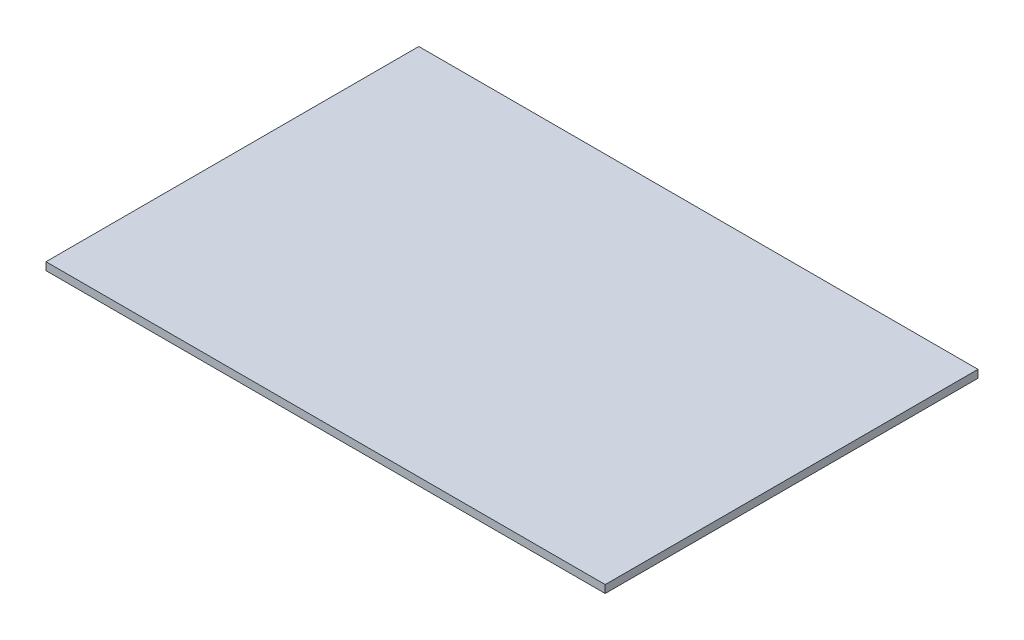
ISO-10303-21;
HEADER;
FILE_DESCRIPTION(('STEP AP214'),'2;1');
FILE_NAME('part.step','',(''),(''),'','','');
FILE_SCHEMA(('AUTOMOTIVE_DESIGN { 1 0 10303 214 1 1 1 1 }'));
ENDSEC;
DATA;
#1=APPLICATION_CONTEXT('core data for automotive mechanical design processes');
#2=APPLICATION_PROTOCOL_DEFINITION('international standard','automotive_design',2000,#1);
#3=PRODUCT_CONTEXT('',#1,'mechanical');
#4=PRODUCT('Part','Part','',(#3));
#5=PRODUCT_RELATED_PRODUCT_CATEGORY('part','',(#4));
#6=PRODUCT_DEFINITION_FORMATION('','',#4);
#7=PRODUCT_DEFINITION_CONTEXT('part definition',#1,'design');
#8=PRODUCT_DEFINITION('design','',#6,#7);
#9=PRODUCT_DEFINITION_SHAPE('','',#8);
#10=(LENGTH_UNIT() NAMED_UNIT(*) SI_UNIT(.MILLI.,.METRE.));
#11=(NAMED_UNIT(*) PLANE_ANGLE_UNIT() SI_UNIT($,.RADIAN.));
#12=(NAMED_UNIT(*) SI_UNIT($,.STERADIAN.) SOLID_ANGLE_UNIT());
#13=UNCERTAINTY_MEASURE_WITH_UNIT(LENGTH_MEASURE(1.E-05),#10,'distance_accuracy_value','');
#14=(GEOMETRIC_REPRESENTATION_CONTEXT(3) GLOBAL_UNCERTAINTY_ASSIGNED_CONTEXT((#13)) GLOBAL_UNIT_ASSIGNED_CONTEXT((#10,
#11,#12)) REPRESENTATION_CONTEXT('',''));
#15=CARTESIAN_POINT('',(0.,0.,0.));
#16=DIRECTION('',(0.,0.,1.));
#17=DIRECTION('',(1.,0.,0.));
#18=AXIS2_PLACEMENT_3D('',#15,#16,#17);
#19=CARTESIAN_POINT('',(0.,3.175,0.));
#20=DIRECTION('',(1.,0.,0.));
#21=DIRECTION('',(0.,0.,-1.));
#22=AXIS2_PLACEMENT_3D('',#19,#20,#21);
#23=PLANE('',#22);
#24=DIRECTION('',(0.,0.,1.));
#25=VECTOR('',#24,1.);
#26=CARTESIAN_POINT('',(0.,0.,0.));
#27=LINE('',#26,#25);
#28=CARTESIAN_POINT('',(0.,0.,-152.4));
#29=VERTEX_POINT('',#28);
#30=CARTESIAN_POINT('',(0.,0.,0.));
#31=VERTEX_POINT('',#30);
#32=EDGE_CURVE('E96',#29,#31,#27,.T.);
#33=ORIENTED_EDGE('',*,*,#32,.T.);
#34=DIRECTION('',(0.,-1.,0.));
#35=VECTOR('',#34,1.);
#36=CARTESIAN_POINT('',(0.,3.175,0.));
#37=LINE('',#36,#35);
#38=CARTESIAN_POINT('',(0.,3.175,0.));
#39=VERTEX_POINT('',#38);
#40=EDGE_CURVE('E11',#39,#31,#37,.T.);
#41=ORIENTED_EDGE('',*,*,#40,.F.);
#42=DIRECTION('',(0.,0.,1.));
#43=VECTOR('',#42,1.);
#44=CARTESIAN_POINT('',(0.,3.175,0.));
#45=LINE('',#44,#43);
#46=CARTESIAN_POINT('',(0.,3.175,-152.4));
#47=VERTEX_POINT('',#46);
#48=EDGE_CURVE('E84',#47,#39,#45,.T.);
#49=ORIENTED_EDGE('',*,*,#48,.F.);
#50=DIRECTION('',(0.,-1.,0.));
#51=VECTOR('',#50,1.);
#52=CARTESIAN_POINT('',(0.,3.175,-152.4));
#53=LINE('',#52,#51);
#54=EDGE_CURVE('E92',#47,#29,#53,.T.);
#55=ORIENTED_EDGE('',*,*,#54,.T.);
#56=EDGE_LOOP('',(#33,#41,#49,#55));
#57=FACE_BOUND('',#56,.T.);
#58=ADVANCED_FACE('F33',(#57),#23,.F.);
#59=CARTESIAN_POINT('',(0.,3.175,0.));
#60=DIRECTION('',(0.,0.,-1.));
#61=DIRECTION('',(-1.,0.,0.));
#62=AXIS2_PLACEMENT_3D('',#59,#60,#61);
#63=PLANE('',#62);
#64=DIRECTION('',(1.,0.,0.));
#65=VECTOR('',#64,1.);
#66=CARTESIAN_POINT('',(0.,0.,0.));
#67=LINE('',#66,#65);
#68=CARTESIAN_POINT('',(228.6,0.,0.));
#69=VERTEX_POINT('',#68);
#70=EDGE_CURVE('E88',#31,#69,#67,.T.);
#71=ORIENTED_EDGE('',*,*,#70,.T.);
#72=DIRECTION('',(0.,-1.,0.));
#73=VECTOR('',#72,1.);
#74=CARTESIAN_POINT('',(228.6,3.175,0.));
#75=LINE('',#74,#73);
#76=CARTESIAN_POINT('',(228.6,3.175,0.));
#77=VERTEX_POINT('',#76);
#78=EDGE_CURVE('E41',#77,#69,#75,.T.);
#79=ORIENTED_EDGE('',*,*,#78,.F.);
#80=DIRECTION('',(1.,0.,0.));
#81=VECTOR('',#80,1.);
#82=CARTESIAN_POINT('',(0.,3.175,0.));
#83=LINE('',#82,#81);
#84=EDGE_CURVE('E79',#39,#77,#83,.T.);
#85=ORIENTED_EDGE('',*,*,#84,.F.);
#86=ORIENTED_EDGE('',*,*,#40,.T.);
#87=EDGE_LOOP('',(#71,#79,#85,#86));
#88=FACE_BOUND('',#87,.T.);
#89=ADVANCED_FACE('F87',(#88),#63,.F.);
#90=CARTESIAN_POINT('',(228.6,3.175,0.));
#91=DIRECTION('',(-1.,0.,0.));
#92=DIRECTION('',(0.,0.,1.));
#93=AXIS2_PLACEMENT_3D('',#90,#91,#92);
#94=PLANE('',#93);
#95=DIRECTION('',(0.,0.,-1.));
#96=VECTOR('',#95,1.);
#97=CARTESIAN_POINT('',(228.6,0.,0.));
#98=LINE('',#97,#96);
#99=CARTESIAN_POINT('',(228.6,0.,-152.4));
#100=VERTEX_POINT('',#99);
#101=EDGE_CURVE('E66',#69,#100,#98,.T.);
#102=ORIENTED_EDGE('',*,*,#101,.T.);
#103=DIRECTION('',(0.,-1.,0.));
#104=VECTOR('',#103,1.);
#105=CARTESIAN_POINT('',(228.6,3.175,-152.4));
#106=LINE('',#105,#104);
#107=CARTESIAN_POINT('',(228.6,3.175,-152.4));
#108=VERTEX_POINT('',#107);
#109=EDGE_CURVE('E89',#108,#100,#106,.T.);
#110=ORIENTED_EDGE('',*,*,#109,.F.);
#111=DIRECTION('',(0.,0.,-1.));
#112=VECTOR('',#111,1.);
#113=CARTESIAN_POINT('',(228.6,3.175,0.));
#114=LINE('',#113,#112);
#115=EDGE_CURVE('E82',#77,#108,#114,.T.);
#116=ORIENTED_EDGE('',*,*,#115,.F.);
#117=ORIENTED_EDGE('',*,*,#78,.T.);
#118=EDGE_LOOP('',(#102,#110,#116,#117));
#119=FACE_BOUND('',#118,.T.);
#120=ADVANCED_FACE('F90',(#119),#94,.F.);
#121=CARTESIAN_POINT('',(0.,3.175,-152.4));
#122=DIRECTION('',(0.,0.,1.));
#123=DIRECTION('',(1.,0.,0.));
#124=AXIS2_PLACEMENT_3D('',#121,#122,#123);
#125=PLANE('',#124);
#126=DIRECTION('',(-1.,0.,0.));
#127=VECTOR('',#126,1.);
#128=CARTESIAN_POINT('',(0.,0.,-152.4));
#129=LINE('',#128,#127);
#130=EDGE_CURVE('E72',#100,#29,#129,.T.);
#131=ORIENTED_EDGE('',*,*,#130,.T.);
#132=ORIENTED_EDGE('',*,*,#54,.F.);
#133=DIRECTION('',(-1.,0.,0.));
#134=VECTOR('',#133,1.);
#135=CARTESIAN_POINT('',(0.,3.175,-152.4));
#136=LINE('',#135,#134);
#137=EDGE_CURVE('E49',#108,#47,#136,.T.);
#138=ORIENTED_EDGE('',*,*,#137,.F.);
#139=ORIENTED_EDGE('',*,*,#109,.T.);
#140=EDGE_LOOP('',(#131,#132,#138,#139));
#141=FACE_BOUND('',#140,.T.);
#142=ADVANCED_FACE('F103',(#141),#125,.F.);
#143=CARTESIAN_POINT('',(0.,3.175,0.));
#144=DIRECTION('',(0.,-1.,0.));
#145=DIRECTION('',(0.,0.,-1.));
#146=AXIS2_PLACEMENT_3D('',#143,#144,#145);
#147=PLANE('',#146);
#148=ORIENTED_EDGE('',*,*,#48,.T.);
#149=ORIENTED_EDGE('',*,*,#84,.T.);
#150=ORIENTED_EDGE('',*,*,#115,.T.);
#151=ORIENTED_EDGE('',*,*,#137,.T.);
#152=EDGE_LOOP('',(#148,#149,#150,#151));
#153=FACE_BOUND('',#152,.T.);
#154=ADVANCED_FACE('F80',(#153),#147,.F.);
#155=CARTESIAN_POINT('',(0.,0.,0.));
#156=DIRECTION('',(0.,-1.,0.));
#157=DIRECTION('',(0.,0.,-1.));
#158=AXIS2_PLACEMENT_3D('',#155,#156,#157);
#159=PLANE('',#158);
#160=ORIENTED_EDGE('',*,*,#32,.F.);
#161=ORIENTED_EDGE('',*,*,#130,.F.);
#162=ORIENTED_EDGE('',*,*,#101,.F.);
#163=ORIENTED_EDGE('',*,*,#70,.F.);
#164=EDGE_LOOP('',(#160,#161,#162,#163));
#165=FACE_BOUND('',#164,.T.);
#166=ADVANCED_FACE('F106',(#165),#159,.T.);
#167=CLOSED_SHELL('',(#58,#89,#120,#142,#154,#166));
#168=MANIFOLD_SOLID_BREP('B2',#167);
#169=ADVANCED_BREP_SHAPE_REPRESENTATION('',(#18,#168),#14);
#170=SHAPE_DEFINITION_REPRESENTATION(#9,#169);
ENDSEC;
END-ISO-10303-21;
